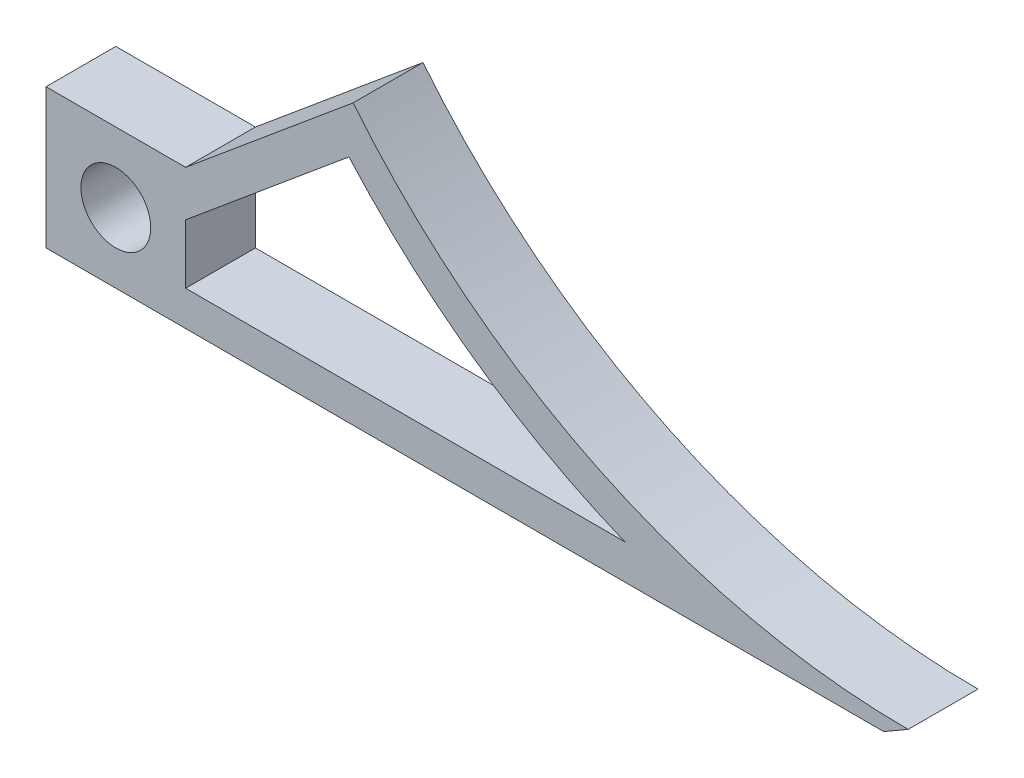
ISO-10303-21;
HEADER;
FILE_DESCRIPTION(('STEP AP214'),'2;1');
FILE_NAME('part.step','',(''),(''),'','','');
FILE_SCHEMA(('AUTOMOTIVE_DESIGN { 1 0 10303 214 1 1 1 1 }'));
ENDSEC;
DATA;
#1=APPLICATION_CONTEXT('core data for automotive mechanical design processes');
#2=APPLICATION_PROTOCOL_DEFINITION('international standard','automotive_design',2000,#1);
#3=PRODUCT_CONTEXT('',#1,'mechanical');
#4=PRODUCT('Part','Part','',(#3));
#5=PRODUCT_RELATED_PRODUCT_CATEGORY('part','',(#4));
#6=PRODUCT_DEFINITION_FORMATION('','',#4);
#7=PRODUCT_DEFINITION_CONTEXT('part definition',#1,'design');
#8=PRODUCT_DEFINITION('design','',#6,#7);
#9=PRODUCT_DEFINITION_SHAPE('','',#8);
#10=(LENGTH_UNIT() NAMED_UNIT(*) SI_UNIT(.MILLI.,.METRE.));
#11=(NAMED_UNIT(*) PLANE_ANGLE_UNIT() SI_UNIT($,.RADIAN.));
#12=(NAMED_UNIT(*) SI_UNIT($,.STERADIAN.) SOLID_ANGLE_UNIT());
#13=UNCERTAINTY_MEASURE_WITH_UNIT(LENGTH_MEASURE(1.E-05),#10,'distance_accuracy_value','');
#14=(GEOMETRIC_REPRESENTATION_CONTEXT(3) GLOBAL_UNCERTAINTY_ASSIGNED_CONTEXT((#13)) GLOBAL_UNIT_ASSIGNED_CONTEXT((#10,
#11,#12)) REPRESENTATION_CONTEXT('',''));
#15=CARTESIAN_POINT('',(0.,0.,0.));
#16=DIRECTION('',(0.,0.,1.));
#17=DIRECTION('',(1.,0.,0.));
#18=AXIS2_PLACEMENT_3D('',#15,#16,#17);
#19=CARTESIAN_POINT('',(72.0752227548751,59.8376804450462,6.35));
#20=DIRECTION('',(0.,0.,1.));
#21=DIRECTION('',(1.,0.,0.));
#22=AXIS2_PLACEMENT_3D('',#19,#20,#21);
#23=PLANE('',#22);
#24=DIRECTION('',(-1.,0.,0.));
#25=VECTOR('',#24,1.);
#26=CARTESIAN_POINT('',(-6.35,6.35,6.35));
#27=LINE('',#26,#25);
#28=CARTESIAN_POINT('',(6.35,6.35,6.35));
#29=VERTEX_POINT('',#28);
#30=CARTESIAN_POINT('',(-6.35,6.35,6.35));
#31=VERTEX_POINT('',#30);
#32=EDGE_CURVE('E173',#29,#31,#27,.T.);
#33=ORIENTED_EDGE('',*,*,#32,.T.);
#34=DIRECTION('',(0.,-1.,0.));
#35=VECTOR('',#34,1.);
#36=CARTESIAN_POINT('',(-6.35,-6.35,6.35));
#37=LINE('',#36,#35);
#38=CARTESIAN_POINT('',(-6.35,-6.35,6.35));
#39=VERTEX_POINT('',#38);
#40=EDGE_CURVE('E177',#31,#39,#37,.T.);
#41=ORIENTED_EDGE('',*,*,#40,.T.);
#42=DIRECTION('',(1.,0.,0.));
#43=VECTOR('',#42,1.);
#44=CARTESIAN_POINT('',(-6.35,-6.35,6.35));
#45=LINE('',#44,#43);
#46=CARTESIAN_POINT('',(69.85,-6.35,6.35));
#47=VERTEX_POINT('',#46);
#48=EDGE_CURVE('E181',#39,#47,#45,.T.);
#49=ORIENTED_EDGE('',*,*,#48,.T.);
#50=DIRECTION('',(0.86602540378444,0.499999999999998,0.));
#51=VECTOR('',#50,1.);
#52=CARTESIAN_POINT('',(69.85,-6.35,6.35));
#53=LINE('',#52,#51);
#54=CARTESIAN_POINT('',(72.0752227548751,-5.06526704346597,6.35));
#55=VERTEX_POINT('',#54);
#56=EDGE_CURVE('E184',#47,#55,#53,.T.);
#57=ORIENTED_EDGE('',*,*,#56,.T.);
#58=CARTESIAN_POINT('',(72.0752227548751,59.8376804450462,6.35));
#59=DIRECTION('',(0.,0.,-1.));
#60=DIRECTION('',(1.,0.,0.));
#61=AXIS2_PLACEMENT_3D('',#58,#59,#60);
#62=CIRCLE('',#61,64.9029474885121);
#63=CARTESIAN_POINT('',(21.59,19.05,6.35));
#64=VERTEX_POINT('',#63);
#65=EDGE_CURVE('E187',#55,#64,#62,.T.);
#66=ORIENTED_EDGE('',*,*,#65,.T.);
#67=DIRECTION('',(-0.768221279597376,-0.64018439966448,0.));
#68=VECTOR('',#67,1.);
#69=CARTESIAN_POINT('',(6.35,6.35,6.35));
#70=LINE('',#69,#68);
#71=EDGE_CURVE('E190',#64,#29,#70,.T.);
#72=ORIENTED_EDGE('',*,*,#71,.T.);
#73=EDGE_LOOP('',(#33,#41,#49,#57,#66,#72));
#74=FACE_BOUND('',#73,.T.);
#75=CARTESIAN_POINT('',(0.,0.,6.35));
#76=DIRECTION('',(0.,0.,1.));
#77=DIRECTION('',(1.,0.,0.));
#78=AXIS2_PLACEMENT_3D('',#75,#76,#77);
#79=CIRCLE('',#78,3.175);
#80=CARTESIAN_POINT('',(3.175,0.,6.35));
#81=VERTEX_POINT('',#80);
#82=EDGE_CURVE('E165',#81,#81,#79,.T.);
#83=ORIENTED_EDGE('',*,*,#82,.F.);
#84=EDGE_LOOP('',(#83));
#85=FACE_BOUND('',#84,.T.);
#86=DIRECTION('',(-0.768221279597376,-0.64018439966448,0.));
#87=VECTOR('',#86,1.);
#88=CARTESIAN_POINT('',(21.2047758979958,14.5960561281626,6.35));
#89=LINE('',#88,#87);
#90=CARTESIAN_POINT('',(21.2047758979958,14.5960561281626,6.35));
#91=VERTEX_POINT('',#90);
#92=CARTESIAN_POINT('',(6.35,2.21707621316606,6.35));
#93=VERTEX_POINT('',#92);
#94=EDGE_CURVE('E126',#91,#93,#89,.T.);
#95=ORIENTED_EDGE('',*,*,#94,.F.);
#96=CARTESIAN_POINT('',(72.0752227548751,59.8376804450462,6.35));
#97=DIRECTION('',(0.,0.,-1.));
#98=DIRECTION('',(1.,0.,0.));
#99=AXIS2_PLACEMENT_3D('',#96,#97,#98);
#100=CIRCLE('',#99,68.0779474885121);
#101=CARTESIAN_POINT('',(46.3068499428578,-3.175,6.35));
#102=VERTEX_POINT('',#101);
#103=EDGE_CURVE('E117',#102,#91,#100,.T.);
#104=ORIENTED_EDGE('',*,*,#103,.F.);
#105=DIRECTION('',(1.,0.,0.));
#106=VECTOR('',#105,1.);
#107=CARTESIAN_POINT('',(6.35,-3.175,6.35));
#108=LINE('',#107,#106);
#109=CARTESIAN_POINT('',(6.35000000000001,-3.175,6.35));
#110=VERTEX_POINT('',#109);
#111=EDGE_CURVE('E143',#110,#102,#108,.T.);
#112=ORIENTED_EDGE('',*,*,#111,.F.);
#113=DIRECTION('',(0.,-1.,0.));
#114=VECTOR('',#113,1.);
#115=CARTESIAN_POINT('',(6.35,2.21707621316606,6.35));
#116=LINE('',#115,#114);
#117=EDGE_CURVE('E139',#93,#110,#116,.T.);
#118=ORIENTED_EDGE('',*,*,#117,.F.);
#119=EDGE_LOOP('',(#95,#104,#112,#118));
#120=FACE_BOUND('',#119,.T.);
#121=ADVANCED_FACE('F39',(#74,#85,#120),#23,.T.);
#122=CARTESIAN_POINT('',(72.0752227548751,59.8376804450462,0.));
#123=DIRECTION('',(0.,0.,1.));
#124=DIRECTION('',(1.,0.,0.));
#125=AXIS2_PLACEMENT_3D('',#122,#123,#124);
#126=PLANE('',#125);
#127=CARTESIAN_POINT('',(0.,0.,0.));
#128=DIRECTION('',(0.,0.,1.));
#129=DIRECTION('',(1.,0.,0.));
#130=AXIS2_PLACEMENT_3D('',#127,#128,#129);
#131=CIRCLE('',#130,3.175);
#132=CARTESIAN_POINT('',(3.175,0.,0.));
#133=VERTEX_POINT('',#132);
#134=EDGE_CURVE('E135',#133,#133,#131,.T.);
#135=ORIENTED_EDGE('',*,*,#134,.T.);
#136=EDGE_LOOP('',(#135));
#137=FACE_BOUND('',#136,.T.);
#138=DIRECTION('',(-1.,0.,0.));
#139=VECTOR('',#138,1.);
#140=CARTESIAN_POINT('',(-6.35,6.35,0.));
#141=LINE('',#140,#139);
#142=CARTESIAN_POINT('',(6.35,6.35,0.));
#143=VERTEX_POINT('',#142);
#144=CARTESIAN_POINT('',(-6.35,6.35,0.));
#145=VERTEX_POINT('',#144);
#146=EDGE_CURVE('E169',#143,#145,#141,.T.);
#147=ORIENTED_EDGE('',*,*,#146,.F.);
#148=DIRECTION('',(-0.768221279597376,-0.64018439966448,0.));
#149=VECTOR('',#148,1.);
#150=CARTESIAN_POINT('',(6.35,6.35,0.));
#151=LINE('',#150,#149);
#152=CARTESIAN_POINT('',(21.59,19.05,0.));
#153=VERTEX_POINT('',#152);
#154=EDGE_CURVE('E178',#153,#143,#151,.T.);
#155=ORIENTED_EDGE('',*,*,#154,.F.);
#156=CARTESIAN_POINT('',(72.0752227548751,59.8376804450462,0.));
#157=DIRECTION('',(0.,0.,-1.));
#158=DIRECTION('',(1.,0.,0.));
#159=AXIS2_PLACEMENT_3D('',#156,#157,#158);
#160=CIRCLE('',#159,64.9029474885121);
#161=CARTESIAN_POINT('',(72.0752227548751,-5.06526704346597,0.));
#162=VERTEX_POINT('',#161);
#163=EDGE_CURVE('E207',#162,#153,#160,.T.);
#164=ORIENTED_EDGE('',*,*,#163,.F.);
#165=DIRECTION('',(0.86602540378444,0.499999999999998,0.));
#166=VECTOR('',#165,1.);
#167=CARTESIAN_POINT('',(69.85,-6.35,0.));
#168=LINE('',#167,#166);
#169=CARTESIAN_POINT('',(69.85,-6.35,0.));
#170=VERTEX_POINT('',#169);
#171=EDGE_CURVE('E204',#170,#162,#168,.T.);
#172=ORIENTED_EDGE('',*,*,#171,.F.);
#173=DIRECTION('',(1.,0.,0.));
#174=VECTOR('',#173,1.);
#175=CARTESIAN_POINT('',(6.35,-6.35,0.));
#176=LINE('',#175,#174);
#177=CARTESIAN_POINT('',(-6.35,-6.35,0.));
#178=VERTEX_POINT('',#177);
#179=EDGE_CURVE('E201',#178,#170,#176,.T.);
#180=ORIENTED_EDGE('',*,*,#179,.F.);
#181=DIRECTION('',(0.,-1.,0.));
#182=VECTOR('',#181,1.);
#183=CARTESIAN_POINT('',(-6.35,-6.35,0.));
#184=LINE('',#183,#182);
#185=EDGE_CURVE('E197',#145,#178,#184,.T.);
#186=ORIENTED_EDGE('',*,*,#185,.F.);
#187=EDGE_LOOP('',(#147,#155,#164,#172,#180,#186));
#188=FACE_BOUND('',#187,.T.);
#189=CARTESIAN_POINT('',(72.0752227548751,59.8376804450462,0.));
#190=DIRECTION('',(0.,0.,-1.));
#191=DIRECTION('',(1.,0.,0.));
#192=AXIS2_PLACEMENT_3D('',#189,#190,#191);
#193=CIRCLE('',#192,68.0779474885121);
#194=CARTESIAN_POINT('',(46.3068499428578,-3.175,0.));
#195=VERTEX_POINT('',#194);
#196=CARTESIAN_POINT('',(21.2047758979958,14.5960561281626,0.));
#197=VERTEX_POINT('',#196);
#198=EDGE_CURVE('E63',#195,#197,#193,.T.);
#199=ORIENTED_EDGE('',*,*,#198,.T.);
#200=DIRECTION('',(-0.768221279597376,-0.64018439966448,0.));
#201=VECTOR('',#200,1.);
#202=CARTESIAN_POINT('',(21.2047758979958,14.5960561281626,0.));
#203=LINE('',#202,#201);
#204=CARTESIAN_POINT('',(6.35,2.21707621316606,0.));
#205=VERTEX_POINT('',#204);
#206=EDGE_CURVE('E133',#197,#205,#203,.T.);
#207=ORIENTED_EDGE('',*,*,#206,.T.);
#208=DIRECTION('',(0.,-1.,0.));
#209=VECTOR('',#208,1.);
#210=CARTESIAN_POINT('',(6.35,2.21707621316606,0.));
#211=LINE('',#210,#209);
#212=CARTESIAN_POINT('',(6.35,-3.175,0.));
#213=VERTEX_POINT('',#212);
#214=EDGE_CURVE('E152',#205,#213,#211,.T.);
#215=ORIENTED_EDGE('',*,*,#214,.T.);
#216=DIRECTION('',(1.,0.,0.));
#217=VECTOR('',#216,1.);
#218=CARTESIAN_POINT('',(6.35,-3.175,0.));
#219=LINE('',#218,#217);
#220=EDGE_CURVE('E127',#213,#195,#219,.T.);
#221=ORIENTED_EDGE('',*,*,#220,.T.);
#222=EDGE_LOOP('',(#199,#207,#215,#221));
#223=FACE_BOUND('',#222,.T.);
#224=ADVANCED_FACE('F238',(#137,#188,#223),#126,.F.);
#225=CARTESIAN_POINT('',(-6.35,6.35,6.35));
#226=DIRECTION('',(0.,-1.,0.));
#227=DIRECTION('',(0.,0.,-1.));
#228=AXIS2_PLACEMENT_3D('',#225,#226,#227);
#229=PLANE('',#228);
#230=ORIENTED_EDGE('',*,*,#146,.T.);
#231=DIRECTION('',(0.,0.,-1.));
#232=VECTOR('',#231,1.);
#233=CARTESIAN_POINT('',(-6.35,6.35,6.35));
#234=LINE('',#233,#232);
#235=EDGE_CURVE('E11',#31,#145,#234,.T.);
#236=ORIENTED_EDGE('',*,*,#235,.F.);
#237=ORIENTED_EDGE('',*,*,#32,.F.);
#238=DIRECTION('',(0.,0.,-1.));
#239=VECTOR('',#238,1.);
#240=CARTESIAN_POINT('',(6.35,6.35,6.35));
#241=LINE('',#240,#239);
#242=EDGE_CURVE('E193',#29,#143,#241,.T.);
#243=ORIENTED_EDGE('',*,*,#242,.T.);
#244=EDGE_LOOP('',(#230,#236,#237,#243));
#245=FACE_BOUND('',#244,.T.);
#246=ADVANCED_FACE('F41',(#245),#229,.F.);
#247=CARTESIAN_POINT('',(-6.35,-6.35,6.35));
#248=DIRECTION('',(1.,0.,0.));
#249=DIRECTION('',(0.,0.,-1.));
#250=AXIS2_PLACEMENT_3D('',#247,#248,#249);
#251=PLANE('',#250);
#252=ORIENTED_EDGE('',*,*,#185,.T.);
#253=DIRECTION('',(0.,0.,-1.));
#254=VECTOR('',#253,1.);
#255=CARTESIAN_POINT('',(-6.35,-6.35,6.35));
#256=LINE('',#255,#254);
#257=EDGE_CURVE('E48',#39,#178,#256,.T.);
#258=ORIENTED_EDGE('',*,*,#257,.F.);
#259=ORIENTED_EDGE('',*,*,#40,.F.);
#260=ORIENTED_EDGE('',*,*,#235,.T.);
#261=EDGE_LOOP('',(#252,#258,#259,#260));
#262=FACE_BOUND('',#261,.T.);
#263=ADVANCED_FACE('F234',(#262),#251,.F.);
#264=CARTESIAN_POINT('',(6.35,-6.35,6.35));
#265=DIRECTION('',(0.,1.,0.));
#266=DIRECTION('',(0.,0.,1.));
#267=AXIS2_PLACEMENT_3D('',#264,#265,#266);
#268=PLANE('',#267);
#269=ORIENTED_EDGE('',*,*,#179,.T.);
#270=DIRECTION('',(0.,0.,-1.));
#271=VECTOR('',#270,1.);
#272=CARTESIAN_POINT('',(69.85,-6.35,6.35));
#273=LINE('',#272,#271);
#274=EDGE_CURVE('E223',#47,#170,#273,.T.);
#275=ORIENTED_EDGE('',*,*,#274,.F.);
#276=ORIENTED_EDGE('',*,*,#48,.F.);
#277=ORIENTED_EDGE('',*,*,#257,.T.);
#278=EDGE_LOOP('',(#269,#275,#276,#277));
#279=FACE_BOUND('',#278,.T.);
#280=ADVANCED_FACE('F231',(#279),#268,.F.);
#281=CARTESIAN_POINT('',(69.85,-6.35,6.35));
#282=DIRECTION('',(-0.499999999999998,0.866025403784439,0.));
#283=DIRECTION('',(-0.86602540378444,-0.499999999999999,0.));
#284=AXIS2_PLACEMENT_3D('',#281,#282,#283);
#285=PLANE('',#284);
#286=ORIENTED_EDGE('',*,*,#171,.T.);
#287=DIRECTION('',(0.,0.,-1.));
#288=VECTOR('',#287,1.);
#289=CARTESIAN_POINT('',(72.0752227548751,-5.06526704346597,6.35));
#290=LINE('',#289,#288);
#291=EDGE_CURVE('E219',#55,#162,#290,.T.);
#292=ORIENTED_EDGE('',*,*,#291,.F.);
#293=ORIENTED_EDGE('',*,*,#56,.F.);
#294=ORIENTED_EDGE('',*,*,#274,.T.);
#295=EDGE_LOOP('',(#286,#292,#293,#294));
#296=FACE_BOUND('',#295,.T.);
#297=ADVANCED_FACE('F245',(#296),#285,.F.);
#298=CARTESIAN_POINT('',(72.0752227548751,59.8376804450462,6.35));
#299=DIRECTION('',(0.,0.,-1.));
#300=DIRECTION('',(-1.,0.,0.));
#301=AXIS2_PLACEMENT_3D('',#298,#299,#300);
#302=CYLINDRICAL_SURFACE('',#301,64.9029474885121);
#303=ORIENTED_EDGE('',*,*,#163,.T.);
#304=DIRECTION('',(0.,0.,-1.));
#305=VECTOR('',#304,1.);
#306=CARTESIAN_POINT('',(21.59,19.05,6.35));
#307=LINE('',#306,#305);
#308=EDGE_CURVE('E215',#64,#153,#307,.T.);
#309=ORIENTED_EDGE('',*,*,#308,.F.);
#310=ORIENTED_EDGE('',*,*,#65,.F.);
#311=ORIENTED_EDGE('',*,*,#291,.T.);
#312=EDGE_LOOP('',(#303,#309,#310,#311));
#313=FACE_BOUND('',#312,.T.);
#314=ADVANCED_FACE('F249',(#313),#302,.F.);
#315=CARTESIAN_POINT('',(6.35,6.35,6.35));
#316=DIRECTION('',(0.64018439966448,-0.768221279597376,0.));
#317=DIRECTION('',(0.768221279597376,0.64018439966448,0.));
#318=AXIS2_PLACEMENT_3D('',#315,#316,#317);
#319=PLANE('',#318);
#320=ORIENTED_EDGE('',*,*,#154,.T.);
#321=ORIENTED_EDGE('',*,*,#242,.F.);
#322=ORIENTED_EDGE('',*,*,#71,.F.);
#323=ORIENTED_EDGE('',*,*,#308,.T.);
#324=EDGE_LOOP('',(#320,#321,#322,#323));
#325=FACE_BOUND('',#324,.T.);
#326=ADVANCED_FACE('F258',(#325),#319,.F.);
#327=CARTESIAN_POINT('',(0.,0.,6.35));
#328=DIRECTION('',(0.,0.,-1.));
#329=DIRECTION('',(-1.,0.,0.));
#330=AXIS2_PLACEMENT_3D('',#327,#328,#329);
#331=CYLINDRICAL_SURFACE('',#330,3.175);
#332=ORIENTED_EDGE('',*,*,#82,.T.);
#333=EDGE_LOOP('',(#332));
#334=FACE_BOUND('',#333,.T.);
#335=ORIENTED_EDGE('',*,*,#134,.F.);
#336=EDGE_LOOP('',(#335));
#337=FACE_BOUND('',#336,.T.);
#338=ADVANCED_FACE('F260',(#334,#337),#331,.F.);
#339=CARTESIAN_POINT('',(72.0752227548751,59.8376804450462,6.35));
#340=DIRECTION('',(0.,0.,-1.));
#341=DIRECTION('',(-1.,0.,0.));
#342=AXIS2_PLACEMENT_3D('',#339,#340,#341);
#343=CYLINDRICAL_SURFACE('',#342,68.0779474885121);
#344=ORIENTED_EDGE('',*,*,#198,.F.);
#345=DIRECTION('',(0.,0.,-1.));
#346=VECTOR('',#345,1.);
#347=CARTESIAN_POINT('',(46.3068499428578,-3.175,6.35));
#348=LINE('',#347,#346);
#349=EDGE_CURVE('E121',#102,#195,#348,.T.);
#350=ORIENTED_EDGE('',*,*,#349,.F.);
#351=ORIENTED_EDGE('',*,*,#103,.T.);
#352=DIRECTION('',(0.,0.,-1.));
#353=VECTOR('',#352,1.);
#354=CARTESIAN_POINT('',(21.2047758979958,14.5960561281626,6.35));
#355=LINE('',#354,#353);
#356=EDGE_CURVE('E120',#91,#197,#355,.T.);
#357=ORIENTED_EDGE('',*,*,#356,.T.);
#358=EDGE_LOOP('',(#344,#350,#351,#357));
#359=FACE_BOUND('',#358,.T.);
#360=ADVANCED_FACE('F119',(#359),#343,.T.);
#361=CARTESIAN_POINT('',(21.2047758979958,14.5960561281626,6.35));
#362=DIRECTION('',(0.64018439966448,-0.768221279597376,0.));
#363=DIRECTION('',(0.768221279597376,0.64018439966448,0.));
#364=AXIS2_PLACEMENT_3D('',#361,#362,#363);
#365=PLANE('',#364);
#366=ORIENTED_EDGE('',*,*,#206,.F.);
#367=ORIENTED_EDGE('',*,*,#356,.F.);
#368=ORIENTED_EDGE('',*,*,#94,.T.);
#369=DIRECTION('',(0.,0.,-1.));
#370=VECTOR('',#369,1.);
#371=CARTESIAN_POINT('',(6.35,2.21707621316606,6.35));
#372=LINE('',#371,#370);
#373=EDGE_CURVE('E136',#93,#205,#372,.T.);
#374=ORIENTED_EDGE('',*,*,#373,.T.);
#375=EDGE_LOOP('',(#366,#367,#368,#374));
#376=FACE_BOUND('',#375,.T.);
#377=ADVANCED_FACE('F130',(#376),#365,.T.);
#378=CARTESIAN_POINT('',(6.35,2.21707621316606,6.35));
#379=DIRECTION('',(1.,0.,0.));
#380=DIRECTION('',(0.,1.,0.));
#381=AXIS2_PLACEMENT_3D('',#378,#379,#380);
#382=PLANE('',#381);
#383=ORIENTED_EDGE('',*,*,#214,.F.);
#384=ORIENTED_EDGE('',*,*,#373,.F.);
#385=ORIENTED_EDGE('',*,*,#117,.T.);
#386=DIRECTION('',(0.,0.,-1.));
#387=VECTOR('',#386,1.);
#388=CARTESIAN_POINT('',(6.35,-3.175,6.35));
#389=LINE('',#388,#387);
#390=EDGE_CURVE('E55',#110,#213,#389,.T.);
#391=ORIENTED_EDGE('',*,*,#390,.T.);
#392=EDGE_LOOP('',(#383,#384,#385,#391));
#393=FACE_BOUND('',#392,.T.);
#394=ADVANCED_FACE('F281',(#393),#382,.T.);
#395=CARTESIAN_POINT('',(6.35,-3.175,6.35));
#396=DIRECTION('',(0.,1.,0.));
#397=DIRECTION('',(-1.,0.,0.));
#398=AXIS2_PLACEMENT_3D('',#395,#396,#397);
#399=PLANE('',#398);
#400=ORIENTED_EDGE('',*,*,#220,.F.);
#401=ORIENTED_EDGE('',*,*,#390,.F.);
#402=ORIENTED_EDGE('',*,*,#111,.T.);
#403=ORIENTED_EDGE('',*,*,#349,.T.);
#404=EDGE_LOOP('',(#400,#401,#402,#403));
#405=FACE_BOUND('',#404,.T.);
#406=ADVANCED_FACE('F284',(#405),#399,.T.);
#407=CLOSED_SHELL('',(#121,#224,#246,#263,#280,#297,#314,#326,#338,#360,#377,#394,#406));
#408=MANIFOLD_SOLID_BREP('B2',#407);
#409=ADVANCED_BREP_SHAPE_REPRESENTATION('',(#18,#408),#14);
#410=SHAPE_DEFINITION_REPRESENTATION(#9,#409);
ENDSEC;
END-ISO-10303-21;
